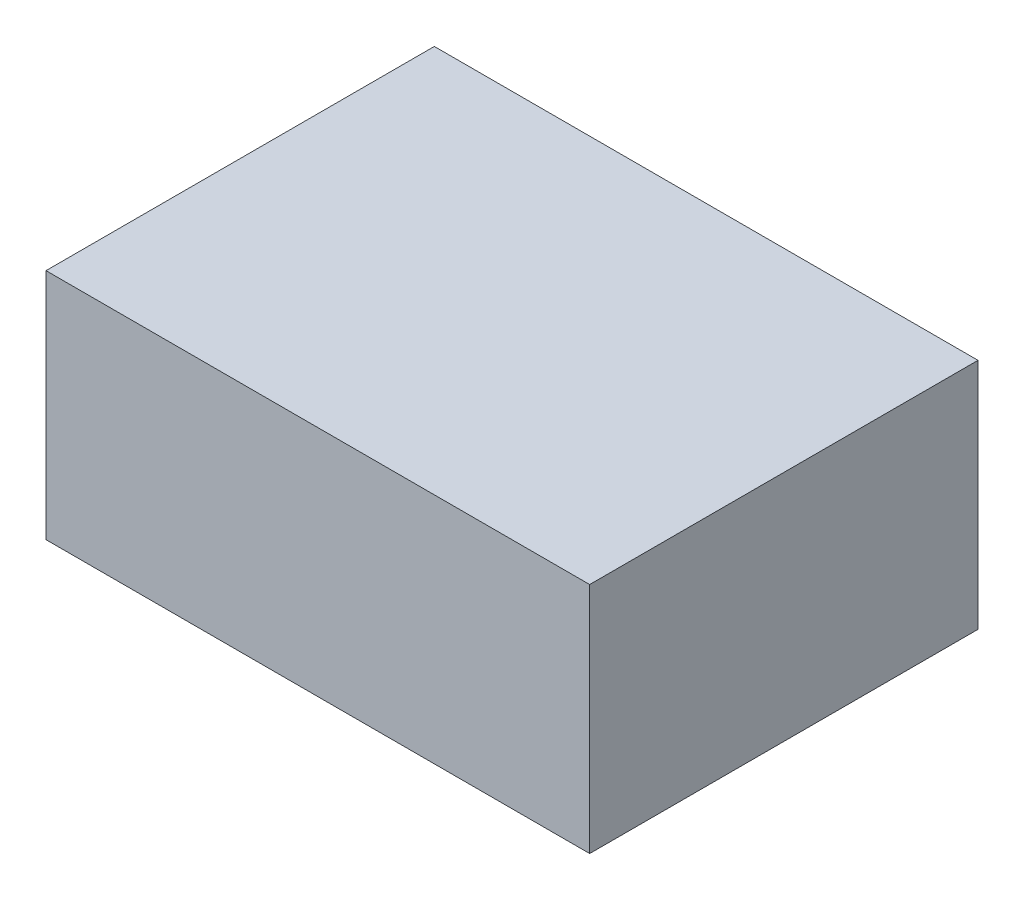
ISO-10303-21;
HEADER;
FILE_DESCRIPTION(('STEP AP214'),'2;1');
FILE_NAME('part.step','',(''),(''),'','','');
FILE_SCHEMA(('AUTOMOTIVE_DESIGN { 1 0 10303 214 1 1 1 1 }'));
ENDSEC;
DATA;
#1=APPLICATION_CONTEXT('core data for automotive mechanical design processes');
#2=APPLICATION_PROTOCOL_DEFINITION('international standard','automotive_design',2000,#1);
#3=PRODUCT_CONTEXT('',#1,'mechanical');
#4=PRODUCT('Part','Part','',(#3));
#5=PRODUCT_RELATED_PRODUCT_CATEGORY('part','',(#4));
#6=PRODUCT_DEFINITION_FORMATION('','',#4);
#7=PRODUCT_DEFINITION_CONTEXT('part definition',#1,'design');
#8=PRODUCT_DEFINITION('design','',#6,#7);
#9=PRODUCT_DEFINITION_SHAPE('','',#8);
#10=(LENGTH_UNIT() NAMED_UNIT(*) SI_UNIT(.MILLI.,.METRE.));
#11=(NAMED_UNIT(*) PLANE_ANGLE_UNIT() SI_UNIT($,.RADIAN.));
#12=(NAMED_UNIT(*) SI_UNIT($,.STERADIAN.) SOLID_ANGLE_UNIT());
#13=UNCERTAINTY_MEASURE_WITH_UNIT(LENGTH_MEASURE(1.E-05),#10,'distance_accuracy_value','');
#14=(GEOMETRIC_REPRESENTATION_CONTEXT(3) GLOBAL_UNCERTAINTY_ASSIGNED_CONTEXT((#13)) GLOBAL_UNIT_ASSIGNED_CONTEXT((#10,
#11,#12)) REPRESENTATION_CONTEXT('',''));
#15=CARTESIAN_POINT('',(0.,0.,0.));
#16=DIRECTION('',(0.,0.,1.));
#17=DIRECTION('',(1.,0.,0.));
#18=AXIS2_PLACEMENT_3D('',#15,#16,#17);
#19=CARTESIAN_POINT('',(17.621402236887,30.,31.0997924218484));
#20=DIRECTION('',(-1.,0.,0.));
#21=DIRECTION('',(0.,0.,1.));
#22=AXIS2_PLACEMENT_3D('',#19,#20,#21);
#23=PLANE('',#22);
#24=DIRECTION('',(0.,0.,-1.));
#25=VECTOR('',#24,1.);
#26=CARTESIAN_POINT('',(17.621402236887,0.,31.0997924218484));
#27=LINE('',#26,#25);
#28=CARTESIAN_POINT('',(17.621402236887,0.,31.0997924218484));
#29=VERTEX_POINT('',#28);
#30=CARTESIAN_POINT('',(17.621402236887,0.,-18.9002075781516));
#31=VERTEX_POINT('',#30);
#32=EDGE_CURVE('E97',#29,#31,#27,.T.);
#33=ORIENTED_EDGE('',*,*,#32,.T.);
#34=DIRECTION('',(0.,-1.,0.));
#35=VECTOR('',#34,1.);
#36=CARTESIAN_POINT('',(17.621402236887,30.,-18.9002075781516));
#37=LINE('',#36,#35);
#38=CARTESIAN_POINT('',(17.621402236887,30.,-18.9002075781516));
#39=VERTEX_POINT('',#38);
#40=EDGE_CURVE('E11',#39,#31,#37,.T.);
#41=ORIENTED_EDGE('',*,*,#40,.F.);
#42=DIRECTION('',(0.,0.,-1.));
#43=VECTOR('',#42,1.);
#44=CARTESIAN_POINT('',(17.621402236887,30.,31.0997924218484));
#45=LINE('',#44,#43);
#46=CARTESIAN_POINT('',(17.621402236887,30.,31.0997924218484));
#47=VERTEX_POINT('',#46);
#48=EDGE_CURVE('E85',#47,#39,#45,.T.);
#49=ORIENTED_EDGE('',*,*,#48,.F.);
#50=DIRECTION('',(0.,-1.,0.));
#51=VECTOR('',#50,1.);
#52=CARTESIAN_POINT('',(17.621402236887,30.,31.0997924218484));
#53=LINE('',#52,#51);
#54=EDGE_CURVE('E93',#47,#29,#53,.T.);
#55=ORIENTED_EDGE('',*,*,#54,.T.);
#56=EDGE_LOOP('',(#33,#41,#49,#55));
#57=FACE_BOUND('',#56,.T.);
#58=ADVANCED_FACE('F34',(#57),#23,.F.);
#59=CARTESIAN_POINT('',(17.621402236887,30.,-18.9002075781516));
#60=DIRECTION('',(0.,0.,1.));
#61=DIRECTION('',(1.,0.,0.));
#62=AXIS2_PLACEMENT_3D('',#59,#60,#61);
#63=PLANE('',#62);
#64=DIRECTION('',(-1.,0.,0.));
#65=VECTOR('',#64,1.);
#66=CARTESIAN_POINT('',(17.621402236887,0.,-18.9002075781516));
#67=LINE('',#66,#65);
#68=CARTESIAN_POINT('',(-52.378597763113,0.,-18.9002075781516));
#69=VERTEX_POINT('',#68);
#70=EDGE_CURVE('E89',#31,#69,#67,.T.);
#71=ORIENTED_EDGE('',*,*,#70,.T.);
#72=DIRECTION('',(0.,-1.,0.));
#73=VECTOR('',#72,1.);
#74=CARTESIAN_POINT('',(-52.378597763113,30.,-18.9002075781516));
#75=LINE('',#74,#73);
#76=CARTESIAN_POINT('',(-52.378597763113,30.,-18.9002075781516));
#77=VERTEX_POINT('',#76);
#78=EDGE_CURVE('E42',#77,#69,#75,.T.);
#79=ORIENTED_EDGE('',*,*,#78,.F.);
#80=DIRECTION('',(-1.,0.,0.));
#81=VECTOR('',#80,1.);
#82=CARTESIAN_POINT('',(17.621402236887,30.,-18.9002075781516));
#83=LINE('',#82,#81);
#84=EDGE_CURVE('E80',#39,#77,#83,.T.);
#85=ORIENTED_EDGE('',*,*,#84,.F.);
#86=ORIENTED_EDGE('',*,*,#40,.T.);
#87=EDGE_LOOP('',(#71,#79,#85,#86));
#88=FACE_BOUND('',#87,.T.);
#89=ADVANCED_FACE('F88',(#88),#63,.F.);
#90=CARTESIAN_POINT('',(-52.378597763113,30.,31.0997924218484));
#91=DIRECTION('',(1.,0.,0.));
#92=DIRECTION('',(0.,0.,-1.));
#93=AXIS2_PLACEMENT_3D('',#90,#91,#92);
#94=PLANE('',#93);
#95=DIRECTION('',(0.,0.,1.));
#96=VECTOR('',#95,1.);
#97=CARTESIAN_POINT('',(-52.378597763113,0.,31.0997924218484));
#98=LINE('',#97,#96);
#99=CARTESIAN_POINT('',(-52.378597763113,0.,31.0997924218484));
#100=VERTEX_POINT('',#99);
#101=EDGE_CURVE('E67',#69,#100,#98,.T.);
#102=ORIENTED_EDGE('',*,*,#101,.T.);
#103=DIRECTION('',(0.,-1.,0.));
#104=VECTOR('',#103,1.);
#105=CARTESIAN_POINT('',(-52.378597763113,30.,31.0997924218484));
#106=LINE('',#105,#104);
#107=CARTESIAN_POINT('',(-52.378597763113,30.,31.0997924218484));
#108=VERTEX_POINT('',#107);
#109=EDGE_CURVE('E90',#108,#100,#106,.T.);
#110=ORIENTED_EDGE('',*,*,#109,.F.);
#111=DIRECTION('',(0.,0.,1.));
#112=VECTOR('',#111,1.);
#113=CARTESIAN_POINT('',(-52.378597763113,30.,31.0997924218484));
#114=LINE('',#113,#112);
#115=EDGE_CURVE('E83',#77,#108,#114,.T.);
#116=ORIENTED_EDGE('',*,*,#115,.F.);
#117=ORIENTED_EDGE('',*,*,#78,.T.);
#118=EDGE_LOOP('',(#102,#110,#116,#117));
#119=FACE_BOUND('',#118,.T.);
#120=ADVANCED_FACE('F91',(#119),#94,.F.);
#121=CARTESIAN_POINT('',(17.621402236887,30.,31.0997924218484));
#122=DIRECTION('',(0.,0.,-1.));
#123=DIRECTION('',(-1.,0.,0.));
#124=AXIS2_PLACEMENT_3D('',#121,#122,#123);
#125=PLANE('',#124);
#126=DIRECTION('',(1.,0.,0.));
#127=VECTOR('',#126,1.);
#128=CARTESIAN_POINT('',(17.621402236887,0.,31.0997924218484));
#129=LINE('',#128,#127);
#130=EDGE_CURVE('E73',#100,#29,#129,.T.);
#131=ORIENTED_EDGE('',*,*,#130,.T.);
#132=ORIENTED_EDGE('',*,*,#54,.F.);
#133=DIRECTION('',(1.,0.,0.));
#134=VECTOR('',#133,1.);
#135=CARTESIAN_POINT('',(17.621402236887,30.,31.0997924218484));
#136=LINE('',#135,#134);
#137=EDGE_CURVE('E50',#108,#47,#136,.T.);
#138=ORIENTED_EDGE('',*,*,#137,.F.);
#139=ORIENTED_EDGE('',*,*,#109,.T.);
#140=EDGE_LOOP('',(#131,#132,#138,#139));
#141=FACE_BOUND('',#140,.T.);
#142=ADVANCED_FACE('F104',(#141),#125,.F.);
#143=CARTESIAN_POINT('',(0.,30.,0.));
#144=DIRECTION('',(0.,1.,0.));
#145=DIRECTION('',(0.,0.,1.));
#146=AXIS2_PLACEMENT_3D('',#143,#144,#145);
#147=PLANE('',#146);
#148=ORIENTED_EDGE('',*,*,#48,.T.);
#149=ORIENTED_EDGE('',*,*,#84,.T.);
#150=ORIENTED_EDGE('',*,*,#115,.T.);
#151=ORIENTED_EDGE('',*,*,#137,.T.);
#152=EDGE_LOOP('',(#148,#149,#150,#151));
#153=FACE_BOUND('',#152,.T.);
#154=ADVANCED_FACE('F81',(#153),#147,.T.);
#155=CARTESIAN_POINT('',(0.,0.,0.));
#156=DIRECTION('',(0.,1.,0.));
#157=DIRECTION('',(0.,0.,1.));
#158=AXIS2_PLACEMENT_3D('',#155,#156,#157);
#159=PLANE('',#158);
#160=ORIENTED_EDGE('',*,*,#32,.F.);
#161=ORIENTED_EDGE('',*,*,#130,.F.);
#162=ORIENTED_EDGE('',*,*,#101,.F.);
#163=ORIENTED_EDGE('',*,*,#70,.F.);
#164=EDGE_LOOP('',(#160,#161,#162,#163));
#165=FACE_BOUND('',#164,.T.);
#166=ADVANCED_FACE('F107',(#165),#159,.F.);
#167=CLOSED_SHELL('',(#58,#89,#120,#142,#154,#166));
#168=MANIFOLD_SOLID_BREP('B2',#167);
#169=ADVANCED_BREP_SHAPE_REPRESENTATION('',(#18,#168),#14);
#170=SHAPE_DEFINITION_REPRESENTATION(#9,#169);
ENDSEC;
END-ISO-10303-21;
